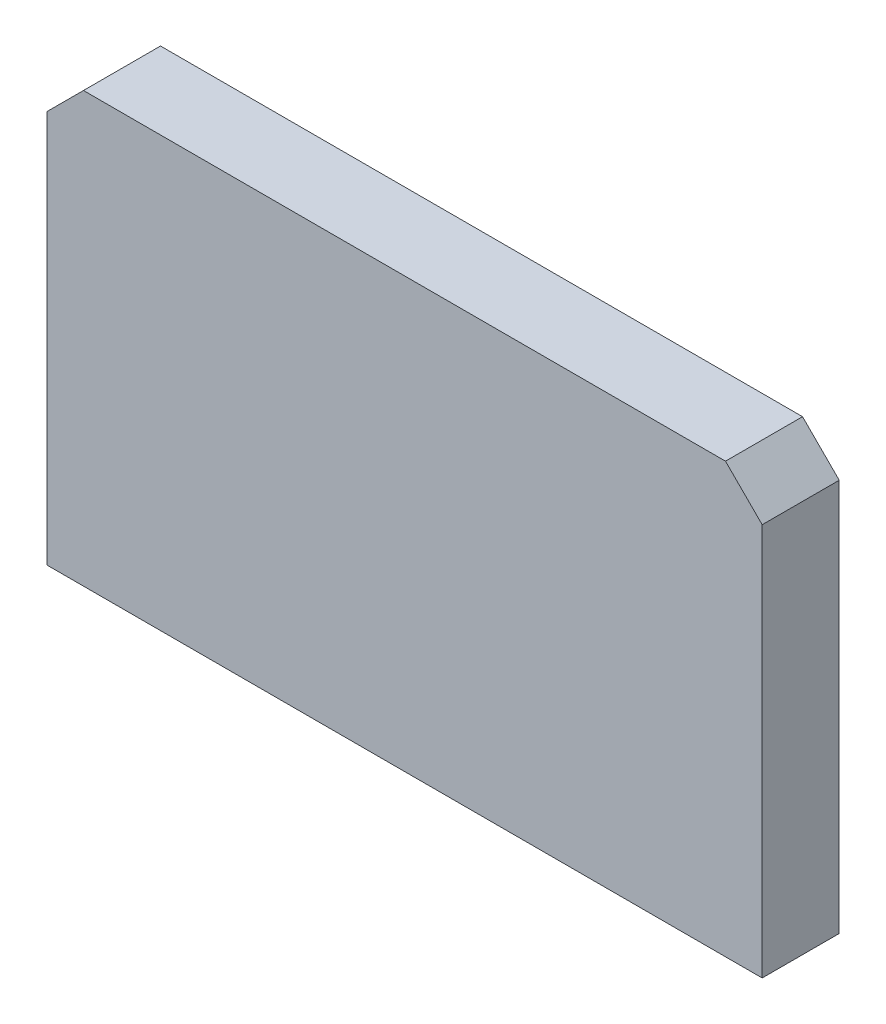
ISO-10303-21;
HEADER;
FILE_DESCRIPTION(('STEP AP214'),'2;1');
FILE_NAME('part.step','',(''),(''),'','','');
FILE_SCHEMA(('AUTOMOTIVE_DESIGN { 1 0 10303 214 1 1 1 1 }'));
ENDSEC;
DATA;
#1=APPLICATION_CONTEXT('core data for automotive mechanical design processes');
#2=APPLICATION_PROTOCOL_DEFINITION('international standard','automotive_design',2000,#1);
#3=PRODUCT_CONTEXT('',#1,'mechanical');
#4=PRODUCT('Part','Part','',(#3));
#5=PRODUCT_RELATED_PRODUCT_CATEGORY('part','',(#4));
#6=PRODUCT_DEFINITION_FORMATION('','',#4);
#7=PRODUCT_DEFINITION_CONTEXT('part definition',#1,'design');
#8=PRODUCT_DEFINITION('design','',#6,#7);
#9=PRODUCT_DEFINITION_SHAPE('','',#8);
#10=(LENGTH_UNIT() NAMED_UNIT(*) SI_UNIT(.MILLI.,.METRE.));
#11=(NAMED_UNIT(*) PLANE_ANGLE_UNIT() SI_UNIT($,.RADIAN.));
#12=(NAMED_UNIT(*) SI_UNIT($,.STERADIAN.) SOLID_ANGLE_UNIT());
#13=UNCERTAINTY_MEASURE_WITH_UNIT(LENGTH_MEASURE(1.E-05),#10,'distance_accuracy_value','');
#14=(GEOMETRIC_REPRESENTATION_CONTEXT(3) GLOBAL_UNCERTAINTY_ASSIGNED_CONTEXT((#13)) GLOBAL_UNIT_ASSIGNED_CONTEXT((#10,
#11,#12)) REPRESENTATION_CONTEXT('',''));
#15=CARTESIAN_POINT('',(0.,0.,0.));
#16=DIRECTION('',(0.,0.,1.));
#17=DIRECTION('',(1.,0.,0.));
#18=AXIS2_PLACEMENT_3D('',#15,#16,#17);
#19=CARTESIAN_POINT('',(-53.5653305643067,-3.20684389745684,0.));
#20=DIRECTION('',(0.,0.,1.));
#21=DIRECTION('',(1.,0.,0.));
#22=AXIS2_PLACEMENT_3D('',#19,#20,#21);
#23=PLANE('',#22);
#24=CARTESIAN_POINT('',(-53.0153305643067,-15.7068438974568,0.));
#25=DIRECTION('',(0.,0.,1.));
#26=DIRECTION('',(1.,0.,0.));
#27=AXIS2_PLACEMENT_3D('',#24,#25,#26);
#28=CIRCLE('',#27,0.925000000000002);
#29=CARTESIAN_POINT('',(-52.0903305643067,-15.7068438974568,0.));
#30=VERTEX_POINT('',#29);
#31=EDGE_CURVE('E139',#30,#30,#28,.F.);
#32=ORIENTED_EDGE('',*,*,#31,.F.);
#33=EDGE_LOOP('',(#32));
#34=FACE_BOUND('',#33,.T.);
#35=CARTESIAN_POINT('',(-53.0153305643067,-11.7068438974568,0.));
#36=DIRECTION('',(0.,0.,1.));
#37=DIRECTION('',(1.,0.,0.));
#38=AXIS2_PLACEMENT_3D('',#35,#36,#37);
#39=CIRCLE('',#38,0.925000000000002);
#40=CARTESIAN_POINT('',(-52.0903305643067,-11.7068438974568,0.));
#41=VERTEX_POINT('',#40);
#42=EDGE_CURVE('E143',#41,#41,#39,.F.);
#43=ORIENTED_EDGE('',*,*,#42,.F.);
#44=EDGE_LOOP('',(#43));
#45=FACE_BOUND('',#44,.T.);
#46=DIRECTION('',(-1.,0.,0.));
#47=VECTOR('',#46,1.);
#48=CARTESIAN_POINT('',(-62.7653305643067,-7.00684389745684,0.));
#49=LINE('',#48,#47);
#50=CARTESIAN_POINT('',(-44.2653305643067,-7.00684389745684,0.));
#51=VERTEX_POINT('',#50);
#52=CARTESIAN_POINT('',(-61.7653305643067,-7.00684389745684,0.));
#53=VERTEX_POINT('',#52);
#54=EDGE_CURVE('E115',#51,#53,#49,.T.);
#55=ORIENTED_EDGE('',*,*,#54,.F.);
#56=DIRECTION('',(-0.707106781186545,0.70710678118655,0.));
#57=VECTOR('',#56,1.);
#58=CARTESIAN_POINT('',(-44.2653305643067,-7.00684389745684,0.));
#59=LINE('',#58,#57);
#60=CARTESIAN_POINT('',(-43.2653305643067,-8.00684389745684,0.));
#61=VERTEX_POINT('',#60);
#62=EDGE_CURVE('E154',#51,#61,#59,.F.);
#63=ORIENTED_EDGE('',*,*,#62,.T.);
#64=DIRECTION('',(0.,1.,0.));
#65=VECTOR('',#64,1.);
#66=CARTESIAN_POINT('',(-43.2653305643067,-7.00684389745684,0.));
#67=LINE('',#66,#65);
#68=CARTESIAN_POINT('',(-43.2653305643067,-18.7068438974568,0.));
#69=VERTEX_POINT('',#68);
#70=EDGE_CURVE('E173',#69,#61,#67,.T.);
#71=ORIENTED_EDGE('',*,*,#70,.F.);
#72=DIRECTION('',(0.707106781186549,0.707106781186546,0.));
#73=VECTOR('',#72,1.);
#74=CARTESIAN_POINT('',(-43.2653305643067,-18.7068438974568,0.));
#75=LINE('',#74,#73);
#76=CARTESIAN_POINT('',(-44.2653305643067,-19.7068438974568,0.));
#77=VERTEX_POINT('',#76);
#78=EDGE_CURVE('E179',#69,#77,#75,.F.);
#79=ORIENTED_EDGE('',*,*,#78,.T.);
#80=DIRECTION('',(1.,0.,0.));
#81=VECTOR('',#80,1.);
#82=CARTESIAN_POINT('',(-62.7653305643067,-19.7068438974568,0.));
#83=LINE('',#82,#81);
#84=CARTESIAN_POINT('',(-61.7653305643067,-19.7068438974568,0.));
#85=VERTEX_POINT('',#84);
#86=EDGE_CURVE('E181',#85,#77,#83,.T.);
#87=ORIENTED_EDGE('',*,*,#86,.F.);
#88=DIRECTION('',(0.707106781186549,-0.707106781186546,0.));
#89=VECTOR('',#88,1.);
#90=CARTESIAN_POINT('',(-61.7653305643067,-19.7068438974568,0.));
#91=LINE('',#90,#89);
#92=CARTESIAN_POINT('',(-62.7653305643067,-18.7068438974568,0.));
#93=VERTEX_POINT('',#92);
#94=EDGE_CURVE('E177',#85,#93,#91,.F.);
#95=ORIENTED_EDGE('',*,*,#94,.T.);
#96=DIRECTION('',(0.,-1.,0.));
#97=VECTOR('',#96,1.);
#98=CARTESIAN_POINT('',(-62.7653305643067,-7.00684389745684,0.));
#99=LINE('',#98,#97);
#100=CARTESIAN_POINT('',(-62.7653305643067,-8.00684389745683,0.));
#101=VERTEX_POINT('',#100);
#102=EDGE_CURVE('E133',#101,#93,#99,.T.);
#103=ORIENTED_EDGE('',*,*,#102,.F.);
#104=DIRECTION('',(-0.707106781186549,-0.707106781186546,0.));
#105=VECTOR('',#104,1.);
#106=CARTESIAN_POINT('',(-62.7653305643067,-8.00684389745683,0.));
#107=LINE('',#106,#105);
#108=EDGE_CURVE('E152',#101,#53,#107,.F.);
#109=ORIENTED_EDGE('',*,*,#108,.T.);
#110=EDGE_LOOP('',(#55,#63,#71,#79,#87,#95,#103,#109));
#111=FACE_BOUND('',#110,.T.);
#112=ADVANCED_FACE('F39',(#34,#45,#111),#23,.F.);
#113=CARTESIAN_POINT('',(-62.7653305643067,-7.00684389745684,2.1));
#114=DIRECTION('',(1.,0.,0.));
#115=DIRECTION('',(0.,0.,-1.));
#116=AXIS2_PLACEMENT_3D('',#113,#114,#115);
#117=PLANE('',#116);
#118=DIRECTION('',(0.,-1.,0.));
#119=VECTOR('',#118,1.);
#120=CARTESIAN_POINT('',(-62.7653305643067,-7.00684389745684,2.1));
#121=LINE('',#120,#119);
#122=CARTESIAN_POINT('',(-62.7653305643067,-8.00684389745683,2.1));
#123=VERTEX_POINT('',#122);
#124=CARTESIAN_POINT('',(-62.7653305643067,-18.7068438974568,2.1));
#125=VERTEX_POINT('',#124);
#126=EDGE_CURVE('E106',#123,#125,#121,.T.);
#127=ORIENTED_EDGE('',*,*,#126,.F.);
#128=DIRECTION('',(0.,0.,-1.));
#129=VECTOR('',#128,1.);
#130=CARTESIAN_POINT('',(-62.7653305643067,-8.00684389745683,2.1));
#131=LINE('',#130,#129);
#132=EDGE_CURVE('E11',#123,#101,#131,.T.);
#133=ORIENTED_EDGE('',*,*,#132,.T.);
#134=ORIENTED_EDGE('',*,*,#102,.T.);
#135=DIRECTION('',(0.,0.,1.));
#136=VECTOR('',#135,1.);
#137=CARTESIAN_POINT('',(-62.7653305643067,-18.7068438974568,2.1));
#138=LINE('',#137,#136);
#139=EDGE_CURVE('E124',#93,#125,#138,.T.);
#140=ORIENTED_EDGE('',*,*,#139,.T.);
#141=EDGE_LOOP('',(#127,#133,#134,#140));
#142=FACE_BOUND('',#141,.T.);
#143=ADVANCED_FACE('F131',(#142),#117,.F.);
#144=CARTESIAN_POINT('',(-62.7653305643067,-19.7068438974568,2.1));
#145=DIRECTION('',(0.,1.,0.));
#146=DIRECTION('',(0.,0.,1.));
#147=AXIS2_PLACEMENT_3D('',#144,#145,#146);
#148=PLANE('',#147);
#149=DIRECTION('',(0.,0.,1.));
#150=VECTOR('',#149,1.);
#151=CARTESIAN_POINT('',(-44.2653305643067,-19.7068438974568,2.1));
#152=LINE('',#151,#150);
#153=CARTESIAN_POINT('',(-44.2653305643067,-19.7068438974568,1.09999999999999));
#154=VERTEX_POINT('',#153);
#155=EDGE_CURVE('E167',#77,#154,#152,.T.);
#156=ORIENTED_EDGE('',*,*,#155,.T.);
#157=DIRECTION('',(-1.,0.,0.));
#158=VECTOR('',#157,1.);
#159=CARTESIAN_POINT('',(-61.7653305643067,-19.7068438974568,1.09999999999999));
#160=LINE('',#159,#158);
#161=CARTESIAN_POINT('',(-61.7653305643067,-19.7068438974568,1.09999999999999));
#162=VERTEX_POINT('',#161);
#163=EDGE_CURVE('E129',#154,#162,#160,.T.);
#164=ORIENTED_EDGE('',*,*,#163,.T.);
#165=DIRECTION('',(0.,0.,-1.));
#166=VECTOR('',#165,1.);
#167=CARTESIAN_POINT('',(-61.7653305643067,-19.7068438974568,2.1));
#168=LINE('',#167,#166);
#169=EDGE_CURVE('E125',#162,#85,#168,.T.);
#170=ORIENTED_EDGE('',*,*,#169,.T.);
#171=ORIENTED_EDGE('',*,*,#86,.T.);
#172=EDGE_LOOP('',(#156,#164,#170,#171));
#173=FACE_BOUND('',#172,.T.);
#174=ADVANCED_FACE('F219',(#173),#148,.F.);
#175=CARTESIAN_POINT('',(0.,0.,2.1));
#176=DIRECTION('',(0.,0.,1.));
#177=DIRECTION('',(1.,0.,0.));
#178=AXIS2_PLACEMENT_3D('',#175,#176,#177);
#179=PLANE('',#178);
#180=DIRECTION('',(0.,1.,0.));
#181=VECTOR('',#180,1.);
#182=CARTESIAN_POINT('',(-43.2653305643067,-7.00684389745684,2.1));
#183=LINE('',#182,#181);
#184=CARTESIAN_POINT('',(-43.2653305643067,-18.7068438974568,2.1));
#185=VERTEX_POINT('',#184);
#186=CARTESIAN_POINT('',(-43.2653305643067,-8.00684389745684,2.1));
#187=VERTEX_POINT('',#186);
#188=EDGE_CURVE('E114',#185,#187,#183,.T.);
#189=ORIENTED_EDGE('',*,*,#188,.T.);
#190=DIRECTION('',(0.707106781186545,-0.70710678118655,0.));
#191=VECTOR('',#190,1.);
#192=CARTESIAN_POINT('',(-25.6360872308819,-25.6360872308817,2.1));
#193=LINE('',#192,#191);
#194=CARTESIAN_POINT('',(-44.2653305643067,-7.00684389745684,2.1));
#195=VERTEX_POINT('',#194);
#196=EDGE_CURVE('E48',#187,#195,#193,.F.);
#197=ORIENTED_EDGE('',*,*,#196,.T.);
#198=DIRECTION('',(-1.,0.,0.));
#199=VECTOR('',#198,1.);
#200=CARTESIAN_POINT('',(-62.7653305643067,-7.00684389745684,2.1));
#201=LINE('',#200,#199);
#202=CARTESIAN_POINT('',(-61.7653305643067,-7.00684389745684,2.1));
#203=VERTEX_POINT('',#202);
#204=EDGE_CURVE('E159',#195,#203,#201,.T.);
#205=ORIENTED_EDGE('',*,*,#204,.T.);
#206=DIRECTION('',(0.707106781186549,0.707106781186546,0.));
#207=VECTOR('',#206,1.);
#208=CARTESIAN_POINT('',(-27.3792433334248,27.3792433334249,2.1));
#209=LINE('',#208,#207);
#210=EDGE_CURVE('E55',#203,#123,#209,.F.);
#211=ORIENTED_EDGE('',*,*,#210,.T.);
#212=ORIENTED_EDGE('',*,*,#126,.T.);
#213=DIRECTION('',(1.,0.,0.));
#214=VECTOR('',#213,1.);
#215=CARTESIAN_POINT('',(-44.2653305643067,-18.7068438974568,2.1));
#216=LINE('',#215,#214);
#217=EDGE_CURVE('E110',#125,#185,#216,.T.);
#218=ORIENTED_EDGE('',*,*,#217,.T.);
#219=EDGE_LOOP('',(#189,#197,#205,#211,#212,#218));
#220=FACE_BOUND('',#219,.T.);
#221=ADVANCED_FACE('F108',(#220),#179,.T.);
#222=CARTESIAN_POINT('',(-43.2653305643067,-7.00684389745684,2.1));
#223=DIRECTION('',(-1.,0.,0.));
#224=DIRECTION('',(0.,0.,1.));
#225=AXIS2_PLACEMENT_3D('',#222,#223,#224);
#226=PLANE('',#225);
#227=ORIENTED_EDGE('',*,*,#70,.T.);
#228=DIRECTION('',(0.,0.,1.));
#229=VECTOR('',#228,1.);
#230=CARTESIAN_POINT('',(-43.2653305643067,-8.00684389745684,2.1));
#231=LINE('',#230,#229);
#232=EDGE_CURVE('E63',#61,#187,#231,.T.);
#233=ORIENTED_EDGE('',*,*,#232,.T.);
#234=ORIENTED_EDGE('',*,*,#188,.F.);
#235=DIRECTION('',(0.,0.,-1.));
#236=VECTOR('',#235,1.);
#237=CARTESIAN_POINT('',(-43.2653305643067,-18.7068438974568,2.1));
#238=LINE('',#237,#236);
#239=EDGE_CURVE('E135',#185,#69,#238,.T.);
#240=ORIENTED_EDGE('',*,*,#239,.T.);
#241=EDGE_LOOP('',(#227,#233,#234,#240));
#242=FACE_BOUND('',#241,.T.);
#243=ADVANCED_FACE('F175',(#242),#226,.F.);
#244=CARTESIAN_POINT('',(-43.2653305643067,-18.7068438974568,2.1));
#245=DIRECTION('',(-0.707106781186546,0.707106781186549,0.));
#246=DIRECTION('',(0.,0.,-1.));
#247=AXIS2_PLACEMENT_3D('',#244,#245,#246);
#248=PLANE('',#247);
#249=ORIENTED_EDGE('',*,*,#239,.F.);
#250=DIRECTION('',(0.577350269189626,0.577350269189624,0.577350269189628));
#251=VECTOR('',#250,1.);
#252=CARTESIAN_POINT('',(-43.2653305643067,-18.7068438974568,2.1));
#253=LINE('',#252,#251);
#254=EDGE_CURVE('E138',#185,#154,#253,.F.);
#255=ORIENTED_EDGE('',*,*,#254,.T.);
#256=ORIENTED_EDGE('',*,*,#155,.F.);
#257=ORIENTED_EDGE('',*,*,#78,.F.);
#258=EDGE_LOOP('',(#249,#255,#256,#257));
#259=FACE_BOUND('',#258,.T.);
#260=ADVANCED_FACE('F232',(#259),#248,.F.);
#261=CARTESIAN_POINT('',(-61.7653305643067,-19.7068438974568,2.1));
#262=DIRECTION('',(0.707106781186546,0.707106781186549,0.));
#263=DIRECTION('',(0.,0.,-1.));
#264=AXIS2_PLACEMENT_3D('',#261,#262,#263);
#265=PLANE('',#264);
#266=ORIENTED_EDGE('',*,*,#169,.F.);
#267=DIRECTION('',(0.577350269189626,-0.577350269189624,-0.577350269189628));
#268=VECTOR('',#267,1.);
#269=CARTESIAN_POINT('',(-62.09866389764,-19.3735105641235,1.43333333333333));
#270=LINE('',#269,#268);
#271=EDGE_CURVE('E121',#162,#125,#270,.F.);
#272=ORIENTED_EDGE('',*,*,#271,.T.);
#273=ORIENTED_EDGE('',*,*,#139,.F.);
#274=ORIENTED_EDGE('',*,*,#94,.F.);
#275=EDGE_LOOP('',(#266,#272,#273,#274));
#276=FACE_BOUND('',#275,.T.);
#277=ADVANCED_FACE('F122',(#276),#265,.F.);
#278=CARTESIAN_POINT('',(-62.7653305643067,-7.00684389745684,2.1));
#279=DIRECTION('',(0.,-1.,0.));
#280=DIRECTION('',(0.,0.,-1.));
#281=AXIS2_PLACEMENT_3D('',#278,#279,#280);
#282=PLANE('',#281);
#283=ORIENTED_EDGE('',*,*,#204,.F.);
#284=DIRECTION('',(0.,0.,-1.));
#285=VECTOR('',#284,1.);
#286=CARTESIAN_POINT('',(-44.2653305643067,-7.00684389745684,2.1));
#287=LINE('',#286,#285);
#288=EDGE_CURVE('E149',#195,#51,#287,.T.);
#289=ORIENTED_EDGE('',*,*,#288,.T.);
#290=ORIENTED_EDGE('',*,*,#54,.T.);
#291=DIRECTION('',(0.,0.,1.));
#292=VECTOR('',#291,1.);
#293=CARTESIAN_POINT('',(-61.7653305643067,-7.00684389745684,2.1));
#294=LINE('',#293,#292);
#295=EDGE_CURVE('E128',#53,#203,#294,.T.);
#296=ORIENTED_EDGE('',*,*,#295,.T.);
#297=EDGE_LOOP('',(#283,#289,#290,#296));
#298=FACE_BOUND('',#297,.T.);
#299=ADVANCED_FACE('F163',(#298),#282,.F.);
#300=CARTESIAN_POINT('',(-53.0153305643067,-11.7068438974568,0.));
#301=DIRECTION('',(0.,0.,1.));
#302=DIRECTION('',(-1.,0.,0.));
#303=AXIS2_PLACEMENT_3D('',#300,#301,#302);
#304=CONICAL_SURFACE('',#303,0.925000000000002,0.0349065850398866);
#305=CARTESIAN_POINT('',(-53.0153305643067,-11.7068438974568,-2.));
#306=DIRECTION('',(0.,0.,-1.));
#307=DIRECTION('',(-1.,0.,0.));
#308=AXIS2_PLACEMENT_3D('',#305,#306,#307);
#309=CIRCLE('',#308,0.855158461016507);
#310=CARTESIAN_POINT('',(-53.8704890253232,-11.7068438974568,-2.));
#311=VERTEX_POINT('',#310);
#312=EDGE_CURVE('E195',#311,#311,#309,.T.);
#313=ORIENTED_EDGE('',*,*,#312,.F.);
#314=EDGE_LOOP('',(#313));
#315=FACE_BOUND('',#314,.T.);
#316=ORIENTED_EDGE('',*,*,#42,.T.);
#317=EDGE_LOOP('',(#316));
#318=FACE_BOUND('',#317,.T.);
#319=ADVANCED_FACE('F221',(#315,#318),#304,.T.);
#320=CARTESIAN_POINT('',(-53.0153305643067,-11.7068438974568,-2.));
#321=DIRECTION('',(0.,0.,-1.));
#322=DIRECTION('',(-1.,0.,0.));
#323=AXIS2_PLACEMENT_3D('',#320,#321,#322);
#324=PLANE('',#323);
#325=ORIENTED_EDGE('',*,*,#312,.T.);
#326=EDGE_LOOP('',(#325));
#327=FACE_BOUND('',#326,.T.);
#328=ADVANCED_FACE('F209',(#327),#324,.T.);
#329=CARTESIAN_POINT('',(-53.0153305643067,-15.7068438974568,0.));
#330=DIRECTION('',(0.,0.,1.));
#331=DIRECTION('',(-1.,0.,0.));
#332=AXIS2_PLACEMENT_3D('',#329,#330,#331);
#333=CONICAL_SURFACE('',#332,0.925000000000002,0.0349065850398866);
#334=CARTESIAN_POINT('',(-53.0153305643067,-15.7068438974568,-2.));
#335=DIRECTION('',(0.,0.,-1.));
#336=DIRECTION('',(-1.,0.,0.));
#337=AXIS2_PLACEMENT_3D('',#334,#335,#336);
#338=CIRCLE('',#337,0.855158461016507);
#339=CARTESIAN_POINT('',(-53.8704890253232,-15.7068438974568,-2.));
#340=VERTEX_POINT('',#339);
#341=EDGE_CURVE('E200',#340,#340,#338,.T.);
#342=ORIENTED_EDGE('',*,*,#341,.F.);
#343=EDGE_LOOP('',(#342));
#344=FACE_BOUND('',#343,.T.);
#345=ORIENTED_EDGE('',*,*,#31,.T.);
#346=EDGE_LOOP('',(#345));
#347=FACE_BOUND('',#346,.T.);
#348=ADVANCED_FACE('F206',(#344,#347),#333,.T.);
#349=CARTESIAN_POINT('',(-53.0153305643067,-15.7068438974568,-2.));
#350=DIRECTION('',(0.,0.,-1.));
#351=DIRECTION('',(-1.,0.,0.));
#352=AXIS2_PLACEMENT_3D('',#349,#350,#351);
#353=PLANE('',#352);
#354=ORIENTED_EDGE('',*,*,#341,.T.);
#355=EDGE_LOOP('',(#354));
#356=FACE_BOUND('',#355,.T.);
#357=ADVANCED_FACE('F204',(#356),#353,.T.);
#358=CARTESIAN_POINT('',(0.,-18.7068438974568,2.1));
#359=DIRECTION('',(0.,-0.70710678118655,0.707106781186545));
#360=DIRECTION('',(-1.,0.,0.));
#361=AXIS2_PLACEMENT_3D('',#358,#359,#360);
#362=PLANE('',#361);
#363=ORIENTED_EDGE('',*,*,#271,.F.);
#364=ORIENTED_EDGE('',*,*,#163,.F.);
#365=ORIENTED_EDGE('',*,*,#254,.F.);
#366=ORIENTED_EDGE('',*,*,#217,.F.);
#367=EDGE_LOOP('',(#363,#364,#365,#366));
#368=FACE_BOUND('',#367,.T.);
#369=ADVANCED_FACE('F137',(#368),#362,.T.);
#370=CARTESIAN_POINT('',(-44.2653305643067,-7.00684389745684,2.1));
#371=DIRECTION('',(-0.70710678118655,-0.707106781186545,0.));
#372=DIRECTION('',(0.,0.,-1.));
#373=AXIS2_PLACEMENT_3D('',#370,#371,#372);
#374=PLANE('',#373);
#375=ORIENTED_EDGE('',*,*,#196,.F.);
#376=ORIENTED_EDGE('',*,*,#232,.F.);
#377=ORIENTED_EDGE('',*,*,#62,.F.);
#378=ORIENTED_EDGE('',*,*,#288,.F.);
#379=EDGE_LOOP('',(#375,#376,#377,#378));
#380=FACE_BOUND('',#379,.T.);
#381=ADVANCED_FACE('F169',(#380),#374,.F.);
#382=CARTESIAN_POINT('',(-62.7653305643067,-8.00684389745683,2.1));
#383=DIRECTION('',(0.707106781186546,-0.707106781186549,0.));
#384=DIRECTION('',(0.,0.,-1.));
#385=AXIS2_PLACEMENT_3D('',#382,#383,#384);
#386=PLANE('',#385);
#387=ORIENTED_EDGE('',*,*,#210,.F.);
#388=ORIENTED_EDGE('',*,*,#295,.F.);
#389=ORIENTED_EDGE('',*,*,#108,.F.);
#390=ORIENTED_EDGE('',*,*,#132,.F.);
#391=EDGE_LOOP('',(#387,#388,#389,#390));
#392=FACE_BOUND('',#391,.T.);
#393=ADVANCED_FACE('F42',(#392),#386,.F.);
#394=CLOSED_SHELL('',(#112,#143,#174,#221,#243,#260,#277,#299,#319,#328,#348,#357,#369,#381,#393));
#395=MANIFOLD_SOLID_BREP('B2',#394);
#396=ADVANCED_BREP_SHAPE_REPRESENTATION('',(#18,#395),#14);
#397=SHAPE_DEFINITION_REPRESENTATION(#9,#396);
ENDSEC;
END-ISO-10303-21;
